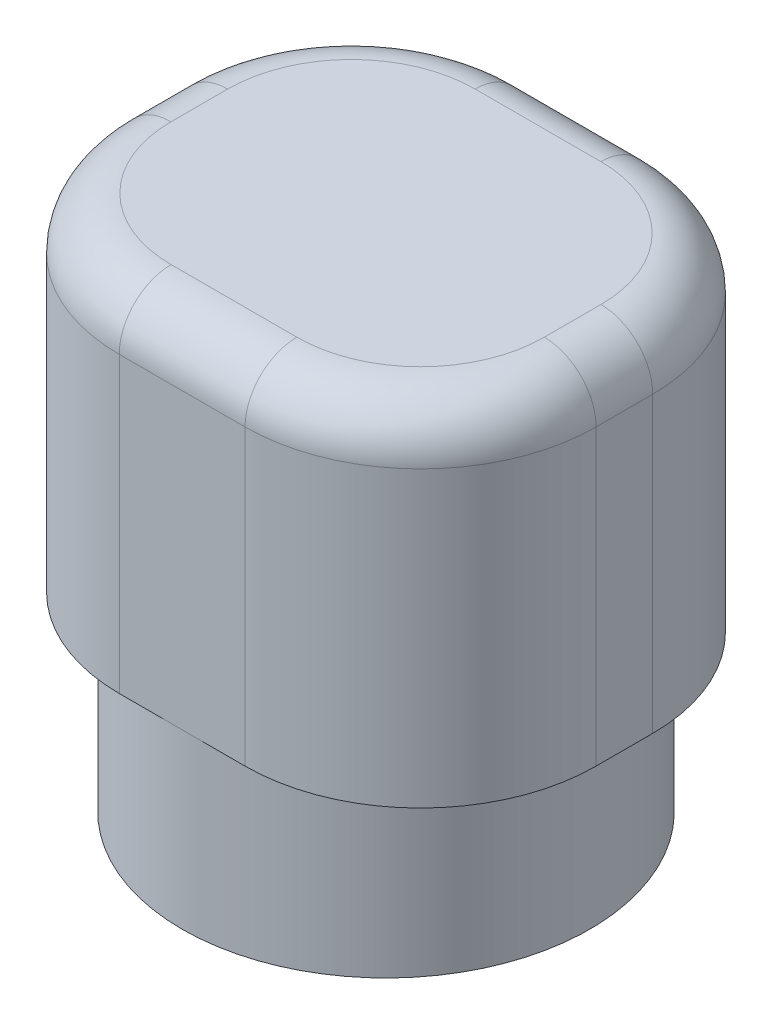
ISO-10303-21;
HEADER;
FILE_DESCRIPTION(('STEP AP214'),'2;1');
FILE_NAME('part.step','',(''),(''),'','','');
FILE_SCHEMA(('AUTOMOTIVE_DESIGN { 1 0 10303 214 1 1 1 1 }'));
ENDSEC;
DATA;
#1=APPLICATION_CONTEXT('core data for automotive mechanical design processes');
#2=APPLICATION_PROTOCOL_DEFINITION('international standard','automotive_design',2000,#1);
#3=PRODUCT_CONTEXT('',#1,'mechanical');
#4=PRODUCT('Part','Part','',(#3));
#5=PRODUCT_RELATED_PRODUCT_CATEGORY('part','',(#4));
#6=PRODUCT_DEFINITION_FORMATION('','',#4);
#7=PRODUCT_DEFINITION_CONTEXT('part definition',#1,'design');
#8=PRODUCT_DEFINITION('design','',#6,#7);
#9=PRODUCT_DEFINITION_SHAPE('','',#8);
#10=(LENGTH_UNIT() NAMED_UNIT(*) SI_UNIT(.MILLI.,.METRE.));
#11=(NAMED_UNIT(*) PLANE_ANGLE_UNIT() SI_UNIT($,.RADIAN.));
#12=(NAMED_UNIT(*) SI_UNIT($,.STERADIAN.) SOLID_ANGLE_UNIT());
#13=UNCERTAINTY_MEASURE_WITH_UNIT(LENGTH_MEASURE(1.E-05),#10,'distance_accuracy_value','');
#14=(GEOMETRIC_REPRESENTATION_CONTEXT(3) GLOBAL_UNCERTAINTY_ASSIGNED_CONTEXT((#13)) GLOBAL_UNIT_ASSIGNED_CONTEXT((#10,
#11,#12)) REPRESENTATION_CONTEXT('',''));
#15=CARTESIAN_POINT('',(0.,0.,0.));
#16=DIRECTION('',(0.,0.,1.));
#17=DIRECTION('',(1.,0.,0.));
#18=AXIS2_PLACEMENT_3D('',#15,#16,#17);
#19=CARTESIAN_POINT('',(0.,2.5,0.));
#20=DIRECTION('',(0.,-1.,0.));
#21=DIRECTION('',(0.,0.,-1.));
#22=AXIS2_PLACEMENT_3D('',#19,#20,#21);
#23=CYLINDRICAL_SURFACE('',#22,2.95);
#24=CARTESIAN_POINT('',(0.,2.5,0.));
#25=DIRECTION('',(0.,1.,0.));
#26=DIRECTION('',(0.,0.,1.));
#27=AXIS2_PLACEMENT_3D('',#24,#25,#26);
#28=CIRCLE('',#27,2.95);
#29=CARTESIAN_POINT('',(0.,2.5,2.95));
#30=VERTEX_POINT('',#29);
#31=CARTESIAN_POINT('',(0.,2.5,-2.95));
#32=VERTEX_POINT('',#31);
#33=EDGE_CURVE('E155',#30,#32,#28,.T.);
#34=ORIENTED_EDGE('',*,*,#33,.F.);
#35=EDGE_CURVE('E157',#32,#30,#28,.T.);
#36=ORIENTED_EDGE('',*,*,#35,.F.);
#37=EDGE_LOOP('',(#34,#36));
#38=FACE_BOUND('',#37,.T.);
#39=CARTESIAN_POINT('',(0.,0.,0.));
#40=DIRECTION('',(0.,1.,0.));
#41=DIRECTION('',(0.,0.,1.));
#42=AXIS2_PLACEMENT_3D('',#39,#40,#41);
#43=CIRCLE('',#42,2.95);
#44=CARTESIAN_POINT('',(0.,0.,2.95));
#45=VERTEX_POINT('',#44);
#46=EDGE_CURVE('E167',#45,#45,#43,.T.);
#47=ORIENTED_EDGE('',*,*,#46,.T.);
#48=EDGE_LOOP('',(#47));
#49=FACE_BOUND('',#48,.T.);
#50=ADVANCED_FACE('F45',(#38,#49),#23,.T.);
#51=CARTESIAN_POINT('',(0.,0.,0.));
#52=DIRECTION('',(0.,1.,0.));
#53=DIRECTION('',(0.,0.,1.));
#54=AXIS2_PLACEMENT_3D('',#51,#52,#53);
#55=PLANE('',#54);
#56=CARTESIAN_POINT('',(0.,0.,0.));
#57=DIRECTION('',(0.,-1.,0.));
#58=DIRECTION('',(0.,0.,-1.));
#59=AXIS2_PLACEMENT_3D('',#56,#57,#58);
#60=CIRCLE('',#59,1.75);
#61=CARTESIAN_POINT('',(0.,0.,-1.75));
#62=VERTEX_POINT('',#61);
#63=EDGE_CURVE('E150',#62,#62,#60,.T.);
#64=ORIENTED_EDGE('',*,*,#63,.F.);
#65=EDGE_LOOP('',(#64));
#66=FACE_BOUND('',#65,.T.);
#67=ORIENTED_EDGE('',*,*,#46,.F.);
#68=EDGE_LOOP('',(#67));
#69=FACE_BOUND('',#68,.T.);
#70=ADVANCED_FACE('F323',(#66,#69),#55,.F.);
#71=CARTESIAN_POINT('',(0.,2.5,0.));
#72=DIRECTION('',(0.,-1.,0.));
#73=DIRECTION('',(0.,0.,-1.));
#74=AXIS2_PLACEMENT_3D('',#71,#72,#73);
#75=CYLINDRICAL_SURFACE('',#74,1.75);
#76=CARTESIAN_POINT('',(0.,2.5,0.));
#77=DIRECTION('',(0.,-1.,0.));
#78=DIRECTION('',(0.,0.,-1.));
#79=AXIS2_PLACEMENT_3D('',#76,#77,#78);
#80=CIRCLE('',#79,1.75);
#81=CARTESIAN_POINT('',(0.,2.5,-1.75));
#82=VERTEX_POINT('',#81);
#83=EDGE_CURVE('E178',#82,#82,#80,.T.);
#84=ORIENTED_EDGE('',*,*,#83,.F.);
#85=EDGE_LOOP('',(#84));
#86=FACE_BOUND('',#85,.T.);
#87=ORIENTED_EDGE('',*,*,#63,.T.);
#88=EDGE_LOOP('',(#87));
#89=FACE_BOUND('',#88,.T.);
#90=ADVANCED_FACE('F330',(#86,#89),#75,.F.);
#91=CARTESIAN_POINT('',(0.,7.5,0.));
#92=DIRECTION('',(0.,1.,0.));
#93=DIRECTION('',(0.,0.,1.));
#94=AXIS2_PLACEMENT_3D('',#91,#92,#93);
#95=PLANE('',#94);
#96=CARTESIAN_POINT('',(0.909999999999999,7.5,0.409999999999999));
#97=DIRECTION('',(0.,1.,0.));
#98=DIRECTION('',(0.,0.,1.));
#99=AXIS2_PLACEMENT_3D('',#96,#97,#98);
#100=CIRCLE('',#99,1.79);
#101=CARTESIAN_POINT('',(0.909999999999999,7.5,2.2));
#102=VERTEX_POINT('',#101);
#103=CARTESIAN_POINT('',(2.7,7.5,0.409999999999999));
#104=VERTEX_POINT('',#103);
#105=EDGE_CURVE('E220',#102,#104,#100,.T.);
#106=ORIENTED_EDGE('',*,*,#105,.T.);
#107=DIRECTION('',(0.,0.,-1.));
#108=VECTOR('',#107,1.);
#109=CARTESIAN_POINT('',(2.7,7.5,-0.410000000000001));
#110=LINE('',#109,#108);
#111=CARTESIAN_POINT('',(2.7,7.5,-0.410000000000001));
#112=VERTEX_POINT('',#111);
#113=EDGE_CURVE('E222',#104,#112,#110,.T.);
#114=ORIENTED_EDGE('',*,*,#113,.T.);
#115=CARTESIAN_POINT('',(0.909999999999998,7.5,-0.41));
#116=DIRECTION('',(0.,1.,0.));
#117=DIRECTION('',(0.,0.,1.));
#118=AXIS2_PLACEMENT_3D('',#115,#116,#117);
#119=CIRCLE('',#118,1.79);
#120=CARTESIAN_POINT('',(0.909999999999998,7.5,-2.2));
#121=VERTEX_POINT('',#120);
#122=EDGE_CURVE('E218',#112,#121,#119,.T.);
#123=ORIENTED_EDGE('',*,*,#122,.T.);
#124=DIRECTION('',(-1.,0.,0.));
#125=VECTOR('',#124,1.);
#126=CARTESIAN_POINT('',(-0.910000000000001,7.5,-2.2));
#127=LINE('',#126,#125);
#128=CARTESIAN_POINT('',(-0.910000000000001,7.5,-2.2));
#129=VERTEX_POINT('',#128);
#130=EDGE_CURVE('E216',#121,#129,#127,.T.);
#131=ORIENTED_EDGE('',*,*,#130,.T.);
#132=CARTESIAN_POINT('',(-0.910000000000001,7.5,-0.41));
#133=DIRECTION('',(0.,1.,0.));
#134=DIRECTION('',(0.,0.,1.));
#135=AXIS2_PLACEMENT_3D('',#132,#133,#134);
#136=CIRCLE('',#135,1.79);
#137=CARTESIAN_POINT('',(-2.7,7.5,-0.41));
#138=VERTEX_POINT('',#137);
#139=EDGE_CURVE('E214',#129,#138,#136,.T.);
#140=ORIENTED_EDGE('',*,*,#139,.T.);
#141=DIRECTION('',(0.,0.,1.));
#142=VECTOR('',#141,1.);
#143=CARTESIAN_POINT('',(-2.7,7.5,0.41));
#144=LINE('',#143,#142);
#145=CARTESIAN_POINT('',(-2.7,7.5,0.41));
#146=VERTEX_POINT('',#145);
#147=EDGE_CURVE('E212',#138,#146,#144,.T.);
#148=ORIENTED_EDGE('',*,*,#147,.T.);
#149=CARTESIAN_POINT('',(-0.910000000000001,7.5,0.409999999999999));
#150=DIRECTION('',(0.,1.,0.));
#151=DIRECTION('',(0.,0.,1.));
#152=AXIS2_PLACEMENT_3D('',#149,#150,#151);
#153=CIRCLE('',#152,1.79);
#154=CARTESIAN_POINT('',(-0.910000000000001,7.5,2.2));
#155=VERTEX_POINT('',#154);
#156=EDGE_CURVE('E210',#146,#155,#153,.T.);
#157=ORIENTED_EDGE('',*,*,#156,.T.);
#158=DIRECTION('',(1.,0.,0.));
#159=VECTOR('',#158,1.);
#160=CARTESIAN_POINT('',(0.909999999999999,7.5,2.2));
#161=LINE('',#160,#159);
#162=EDGE_CURVE('E208',#155,#102,#161,.T.);
#163=ORIENTED_EDGE('',*,*,#162,.T.);
#164=EDGE_LOOP('',(#106,#114,#123,#131,#140,#148,#157,#163));
#165=FACE_BOUND('',#164,.T.);
#166=ADVANCED_FACE('F292',(#165),#95,.T.);
#167=CARTESIAN_POINT('',(-3.45,7.5,2.95));
#168=DIRECTION('',(0.,0.,-1.));
#169=DIRECTION('',(-1.,0.,0.));
#170=AXIS2_PLACEMENT_3D('',#167,#168,#169);
#171=PLANE('',#170);
#172=DIRECTION('',(0.,-1.,0.));
#173=VECTOR('',#172,1.);
#174=CARTESIAN_POINT('',(0.909999999999999,7.5,2.95));
#175=LINE('',#174,#173);
#176=CARTESIAN_POINT('',(0.909999999999999,2.5,2.95));
#177=VERTEX_POINT('',#176);
#178=CARTESIAN_POINT('',(0.909999999999999,6.75,2.95));
#179=VERTEX_POINT('',#178);
#180=EDGE_CURVE('E206',#177,#179,#175,.F.);
#181=ORIENTED_EDGE('',*,*,#180,.T.);
#182=DIRECTION('',(1.,0.,0.));
#183=VECTOR('',#182,1.);
#184=CARTESIAN_POINT('',(-0.910000000000001,6.75,2.95));
#185=LINE('',#184,#183);
#186=CARTESIAN_POINT('',(-0.910000000000001,6.75,2.95));
#187=VERTEX_POINT('',#186);
#188=EDGE_CURVE('E11',#179,#187,#185,.F.);
#189=ORIENTED_EDGE('',*,*,#188,.T.);
#190=DIRECTION('',(0.,-1.,0.));
#191=VECTOR('',#190,1.);
#192=CARTESIAN_POINT('',(-0.910000000000001,7.5,2.95));
#193=LINE('',#192,#191);
#194=CARTESIAN_POINT('',(-0.910000000000001,2.5,2.95));
#195=VERTEX_POINT('',#194);
#196=EDGE_CURVE('E146',#187,#195,#193,.T.);
#197=ORIENTED_EDGE('',*,*,#196,.T.);
#198=DIRECTION('',(1.,0.,0.));
#199=VECTOR('',#198,1.);
#200=CARTESIAN_POINT('',(-3.45,2.5,2.95));
#201=LINE('',#200,#199);
#202=EDGE_CURVE('E140',#195,#30,#201,.T.);
#203=ORIENTED_EDGE('',*,*,#202,.T.);
#204=EDGE_CURVE('E144',#30,#177,#201,.T.);
#205=ORIENTED_EDGE('',*,*,#204,.T.);
#206=EDGE_LOOP('',(#181,#189,#197,#203,#205));
#207=FACE_BOUND('',#206,.T.);
#208=ADVANCED_FACE('F142',(#207),#171,.F.);
#209=CARTESIAN_POINT('',(-3.45,7.5,-2.95));
#210=DIRECTION('',(1.,0.,0.));
#211=DIRECTION('',(0.,0.,-1.));
#212=AXIS2_PLACEMENT_3D('',#209,#210,#211);
#213=PLANE('',#212);
#214=DIRECTION('',(0.,-1.,0.));
#215=VECTOR('',#214,1.);
#216=CARTESIAN_POINT('',(-3.45,7.5,0.41));
#217=LINE('',#216,#215);
#218=CARTESIAN_POINT('',(-3.45,2.5,0.41));
#219=VERTEX_POINT('',#218);
#220=CARTESIAN_POINT('',(-3.45,6.75,0.41));
#221=VERTEX_POINT('',#220);
#222=EDGE_CURVE('E161',#219,#221,#217,.F.);
#223=ORIENTED_EDGE('',*,*,#222,.T.);
#224=DIRECTION('',(0.,0.,1.));
#225=VECTOR('',#224,1.);
#226=CARTESIAN_POINT('',(-3.45,6.75,-0.41));
#227=LINE('',#226,#225);
#228=CARTESIAN_POINT('',(-3.45,6.75,-0.41));
#229=VERTEX_POINT('',#228);
#230=EDGE_CURVE('E236',#221,#229,#227,.F.);
#231=ORIENTED_EDGE('',*,*,#230,.T.);
#232=DIRECTION('',(0.,-1.,0.));
#233=VECTOR('',#232,1.);
#234=CARTESIAN_POINT('',(-3.45,7.5,-0.41));
#235=LINE('',#234,#233);
#236=CARTESIAN_POINT('',(-3.45,2.5,-0.41));
#237=VERTEX_POINT('',#236);
#238=EDGE_CURVE('E186',#229,#237,#235,.T.);
#239=ORIENTED_EDGE('',*,*,#238,.T.);
#240=DIRECTION('',(0.,0.,1.));
#241=VECTOR('',#240,1.);
#242=CARTESIAN_POINT('',(-3.45,2.5,-2.95));
#243=LINE('',#242,#241);
#244=EDGE_CURVE('E172',#237,#219,#243,.T.);
#245=ORIENTED_EDGE('',*,*,#244,.T.);
#246=EDGE_LOOP('',(#223,#231,#239,#245));
#247=FACE_BOUND('',#246,.T.);
#248=ADVANCED_FACE('F309',(#247),#213,.F.);
#249=CARTESIAN_POINT('',(-3.45,7.5,-2.95));
#250=DIRECTION('',(0.,0.,1.));
#251=DIRECTION('',(1.,0.,0.));
#252=AXIS2_PLACEMENT_3D('',#249,#250,#251);
#253=PLANE('',#252);
#254=DIRECTION('',(0.,-1.,0.));
#255=VECTOR('',#254,1.);
#256=CARTESIAN_POINT('',(-0.910000000000001,7.5,-2.95));
#257=LINE('',#256,#255);
#258=CARTESIAN_POINT('',(-0.910000000000001,2.5,-2.95));
#259=VERTEX_POINT('',#258);
#260=CARTESIAN_POINT('',(-0.910000000000001,6.75,-2.95));
#261=VERTEX_POINT('',#260);
#262=EDGE_CURVE('E194',#259,#261,#257,.F.);
#263=ORIENTED_EDGE('',*,*,#262,.T.);
#264=DIRECTION('',(-1.,0.,0.));
#265=VECTOR('',#264,1.);
#266=CARTESIAN_POINT('',(0.909999999999998,6.75,-2.95));
#267=LINE('',#266,#265);
#268=CARTESIAN_POINT('',(0.909999999999998,6.75,-2.95));
#269=VERTEX_POINT('',#268);
#270=EDGE_CURVE('E232',#261,#269,#267,.F.);
#271=ORIENTED_EDGE('',*,*,#270,.T.);
#272=DIRECTION('',(0.,-1.,0.));
#273=VECTOR('',#272,1.);
#274=CARTESIAN_POINT('',(0.909999999999998,7.5,-2.95));
#275=LINE('',#274,#273);
#276=CARTESIAN_POINT('',(0.909999999999998,2.5,-2.95));
#277=VERTEX_POINT('',#276);
#278=EDGE_CURVE('E192',#269,#277,#275,.T.);
#279=ORIENTED_EDGE('',*,*,#278,.T.);
#280=DIRECTION('',(-1.,0.,0.));
#281=VECTOR('',#280,1.);
#282=CARTESIAN_POINT('',(-3.45,2.5,-2.95));
#283=LINE('',#282,#281);
#284=EDGE_CURVE('E174',#277,#32,#283,.T.);
#285=ORIENTED_EDGE('',*,*,#284,.T.);
#286=EDGE_CURVE('E166',#32,#259,#283,.T.);
#287=ORIENTED_EDGE('',*,*,#286,.T.);
#288=EDGE_LOOP('',(#263,#271,#279,#285,#287));
#289=FACE_BOUND('',#288,.T.);
#290=ADVANCED_FACE('F270',(#289),#253,.F.);
#291=CARTESIAN_POINT('',(3.45,7.5,-2.95));
#292=DIRECTION('',(-1.,0.,0.));
#293=DIRECTION('',(0.,0.,1.));
#294=AXIS2_PLACEMENT_3D('',#291,#292,#293);
#295=PLANE('',#294);
#296=DIRECTION('',(0.,-1.,0.));
#297=VECTOR('',#296,1.);
#298=CARTESIAN_POINT('',(3.45,7.5,-0.410000000000001));
#299=LINE('',#298,#297);
#300=CARTESIAN_POINT('',(3.45,2.5,-0.410000000000001));
#301=VERTEX_POINT('',#300);
#302=CARTESIAN_POINT('',(3.45,6.75,-0.410000000000001));
#303=VERTEX_POINT('',#302);
#304=EDGE_CURVE('E202',#301,#303,#299,.F.);
#305=ORIENTED_EDGE('',*,*,#304,.T.);
#306=DIRECTION('',(0.,0.,-1.));
#307=VECTOR('',#306,1.);
#308=CARTESIAN_POINT('',(3.45,6.75,0.409999999999999));
#309=LINE('',#308,#307);
#310=CARTESIAN_POINT('',(3.45,6.75,0.409999999999999));
#311=VERTEX_POINT('',#310);
#312=EDGE_CURVE('E225',#303,#311,#309,.F.);
#313=ORIENTED_EDGE('',*,*,#312,.T.);
#314=DIRECTION('',(0.,-1.,0.));
#315=VECTOR('',#314,1.);
#316=CARTESIAN_POINT('',(3.45,7.5,0.409999999999999));
#317=LINE('',#316,#315);
#318=CARTESIAN_POINT('',(3.45,2.5,0.409999999999999));
#319=VERTEX_POINT('',#318);
#320=EDGE_CURVE('E200',#311,#319,#317,.T.);
#321=ORIENTED_EDGE('',*,*,#320,.T.);
#322=DIRECTION('',(0.,0.,-1.));
#323=VECTOR('',#322,1.);
#324=CARTESIAN_POINT('',(3.45,2.5,-2.95));
#325=LINE('',#324,#323);
#326=EDGE_CURVE('E261',#319,#301,#325,.T.);
#327=ORIENTED_EDGE('',*,*,#326,.T.);
#328=EDGE_LOOP('',(#305,#313,#321,#327));
#329=FACE_BOUND('',#328,.T.);
#330=ADVANCED_FACE('F279',(#329),#295,.F.);
#331=CARTESIAN_POINT('',(0.,2.5,0.));
#332=DIRECTION('',(0.,1.,0.));
#333=DIRECTION('',(0.,0.,1.));
#334=AXIS2_PLACEMENT_3D('',#331,#332,#333);
#335=PLANE('',#334);
#336=ORIENTED_EDGE('',*,*,#244,.F.);
#337=CARTESIAN_POINT('',(-0.910000000000001,2.5,-0.41));
#338=DIRECTION('',(0.,1.,0.));
#339=DIRECTION('',(0.,0.,1.));
#340=AXIS2_PLACEMENT_3D('',#337,#338,#339);
#341=CIRCLE('',#340,2.54);
#342=EDGE_CURVE('E190',#237,#259,#341,.F.);
#343=ORIENTED_EDGE('',*,*,#342,.T.);
#344=ORIENTED_EDGE('',*,*,#286,.F.);
#345=ORIENTED_EDGE('',*,*,#35,.T.);
#346=ORIENTED_EDGE('',*,*,#202,.F.);
#347=CARTESIAN_POINT('',(-0.910000000000001,2.5,0.409999999999999));
#348=DIRECTION('',(0.,1.,0.));
#349=DIRECTION('',(0.,0.,1.));
#350=AXIS2_PLACEMENT_3D('',#347,#348,#349);
#351=CIRCLE('',#350,2.54);
#352=EDGE_CURVE('E188',#195,#219,#351,.F.);
#353=ORIENTED_EDGE('',*,*,#352,.T.);
#354=EDGE_LOOP('',(#336,#343,#344,#345,#346,#353));
#355=FACE_BOUND('',#354,.T.);
#356=ADVANCED_FACE('F164',(#355),#335,.F.);
#357=ORIENTED_EDGE('',*,*,#284,.F.);
#358=CARTESIAN_POINT('',(0.909999999999998,2.5,-0.41));
#359=DIRECTION('',(0.,1.,0.));
#360=DIRECTION('',(0.,0.,1.));
#361=AXIS2_PLACEMENT_3D('',#358,#359,#360);
#362=CIRCLE('',#361,2.54);
#363=EDGE_CURVE('E198',#277,#301,#362,.F.);
#364=ORIENTED_EDGE('',*,*,#363,.T.);
#365=ORIENTED_EDGE('',*,*,#326,.F.);
#366=CARTESIAN_POINT('',(0.909999999999999,2.5,0.409999999999999));
#367=DIRECTION('',(0.,1.,0.));
#368=DIRECTION('',(0.,0.,1.));
#369=AXIS2_PLACEMENT_3D('',#366,#367,#368);
#370=CIRCLE('',#369,2.54);
#371=EDGE_CURVE('E171',#319,#177,#370,.F.);
#372=ORIENTED_EDGE('',*,*,#371,.T.);
#373=ORIENTED_EDGE('',*,*,#204,.F.);
#374=ORIENTED_EDGE('',*,*,#33,.T.);
#375=EDGE_LOOP('',(#357,#364,#365,#372,#373,#374));
#376=FACE_BOUND('',#375,.T.);
#377=ADVANCED_FACE('F168',(#376),#335,.F.);
#378=ORIENTED_EDGE('',*,*,#83,.T.);
#379=EDGE_LOOP('',(#378));
#380=FACE_BOUND('',#379,.T.);
#381=ADVANCED_FACE('F337',(#380),#335,.F.);
#382=CARTESIAN_POINT('',(-0.910000000000001,7.5,-0.41));
#383=DIRECTION('',(0.,-1.,0.));
#384=DIRECTION('',(0.,0.,-1.));
#385=AXIS2_PLACEMENT_3D('',#382,#383,#384);
#386=CYLINDRICAL_SURFACE('',#385,2.54);
#387=ORIENTED_EDGE('',*,*,#238,.F.);
#388=CARTESIAN_POINT('',(-0.910000000000001,6.75,-0.41));
#389=DIRECTION('',(0.,1.,0.));
#390=DIRECTION('',(0.,0.,1.));
#391=AXIS2_PLACEMENT_3D('',#388,#389,#390);
#392=CIRCLE('',#391,2.54);
#393=EDGE_CURVE('E234',#229,#261,#392,.F.);
#394=ORIENTED_EDGE('',*,*,#393,.T.);
#395=ORIENTED_EDGE('',*,*,#262,.F.);
#396=ORIENTED_EDGE('',*,*,#342,.F.);
#397=EDGE_LOOP('',(#387,#394,#395,#396));
#398=FACE_BOUND('',#397,.T.);
#399=ADVANCED_FACE('F312',(#398),#386,.T.);
#400=CARTESIAN_POINT('',(0.909999999999998,7.5,-0.41));
#401=DIRECTION('',(0.,-1.,0.));
#402=DIRECTION('',(0.,0.,-1.));
#403=AXIS2_PLACEMENT_3D('',#400,#401,#402);
#404=CYLINDRICAL_SURFACE('',#403,2.54);
#405=ORIENTED_EDGE('',*,*,#278,.F.);
#406=CARTESIAN_POINT('',(0.909999999999998,6.75,-0.41));
#407=DIRECTION('',(0.,1.,0.));
#408=DIRECTION('',(0.,0.,1.));
#409=AXIS2_PLACEMENT_3D('',#406,#407,#408);
#410=CIRCLE('',#409,2.54);
#411=EDGE_CURVE('E230',#269,#303,#410,.F.);
#412=ORIENTED_EDGE('',*,*,#411,.T.);
#413=ORIENTED_EDGE('',*,*,#304,.F.);
#414=ORIENTED_EDGE('',*,*,#363,.F.);
#415=EDGE_LOOP('',(#405,#412,#413,#414));
#416=FACE_BOUND('',#415,.T.);
#417=ADVANCED_FACE('F275',(#416),#404,.T.);
#418=CARTESIAN_POINT('',(0.909999999999999,7.5,0.409999999999999));
#419=DIRECTION('',(0.,-1.,0.));
#420=DIRECTION('',(0.,0.,-1.));
#421=AXIS2_PLACEMENT_3D('',#418,#419,#420);
#422=CYLINDRICAL_SURFACE('',#421,2.54);
#423=ORIENTED_EDGE('',*,*,#320,.F.);
#424=CARTESIAN_POINT('',(0.909999999999999,6.75,0.409999999999999));
#425=DIRECTION('',(0.,1.,0.));
#426=DIRECTION('',(0.,0.,1.));
#427=AXIS2_PLACEMENT_3D('',#424,#425,#426);
#428=CIRCLE('',#427,2.54);
#429=EDGE_CURVE('E228',#311,#179,#428,.F.);
#430=ORIENTED_EDGE('',*,*,#429,.T.);
#431=ORIENTED_EDGE('',*,*,#180,.F.);
#432=ORIENTED_EDGE('',*,*,#371,.F.);
#433=EDGE_LOOP('',(#423,#430,#431,#432));
#434=FACE_BOUND('',#433,.T.);
#435=ADVANCED_FACE('F299',(#434),#422,.T.);
#436=CARTESIAN_POINT('',(-0.910000000000001,7.5,0.409999999999999));
#437=DIRECTION('',(0.,-1.,0.));
#438=DIRECTION('',(0.,0.,-1.));
#439=AXIS2_PLACEMENT_3D('',#436,#437,#438);
#440=CYLINDRICAL_SURFACE('',#439,2.54);
#441=ORIENTED_EDGE('',*,*,#196,.F.);
#442=CARTESIAN_POINT('',(-0.910000000000001,6.75,0.409999999999999));
#443=DIRECTION('',(0.,1.,0.));
#444=DIRECTION('',(0.,0.,1.));
#445=AXIS2_PLACEMENT_3D('',#442,#443,#444);
#446=CIRCLE('',#445,2.54);
#447=EDGE_CURVE('E54',#187,#221,#446,.F.);
#448=ORIENTED_EDGE('',*,*,#447,.T.);
#449=ORIENTED_EDGE('',*,*,#222,.F.);
#450=ORIENTED_EDGE('',*,*,#352,.F.);
#451=EDGE_LOOP('',(#441,#448,#449,#450));
#452=FACE_BOUND('',#451,.T.);
#453=ADVANCED_FACE('F313',(#452),#440,.T.);
#454=CARTESIAN_POINT('',(-2.7,6.75,0.));
#455=DIRECTION('',(0.,0.,-1.));
#456=DIRECTION('',(-1.,0.,0.));
#457=AXIS2_PLACEMENT_3D('',#454,#455,#456);
#458=CYLINDRICAL_SURFACE('',#457,0.75);
#459=CARTESIAN_POINT('',(-2.7,6.75,-0.41));
#460=DIRECTION('',(0.,0.,-1.));
#461=DIRECTION('',(-1.,0.,0.));
#462=AXIS2_PLACEMENT_3D('',#459,#460,#461);
#463=CIRCLE('',#462,0.75);
#464=EDGE_CURVE('E254',#229,#138,#463,.T.);
#465=ORIENTED_EDGE('',*,*,#464,.F.);
#466=ORIENTED_EDGE('',*,*,#230,.F.);
#467=CARTESIAN_POINT('',(-2.7,6.75,0.41));
#468=DIRECTION('',(0.,0.,1.));
#469=DIRECTION('',(1.,0.,0.));
#470=AXIS2_PLACEMENT_3D('',#467,#468,#469);
#471=CIRCLE('',#470,0.75);
#472=EDGE_CURVE('E49',#146,#221,#471,.T.);
#473=ORIENTED_EDGE('',*,*,#472,.F.);
#474=ORIENTED_EDGE('',*,*,#147,.F.);
#475=EDGE_LOOP('',(#465,#466,#473,#474));
#476=FACE_BOUND('',#475,.T.);
#477=ADVANCED_FACE('F47',(#476),#458,.T.);
#478=CARTESIAN_POINT('',(-0.910000000000001,6.75,0.409999999999999));
#479=DIRECTION('',(0.,1.,0.));
#480=DIRECTION('',(0.,0.,1.));
#481=AXIS2_PLACEMENT_3D('',#478,#479,#480);
#482=TOROIDAL_SURFACE('',#481,1.79,0.75);
#483=ORIENTED_EDGE('',*,*,#472,.T.);
#484=ORIENTED_EDGE('',*,*,#447,.F.);
#485=CARTESIAN_POINT('',(-0.910000000000001,6.75,2.2));
#486=DIRECTION('',(1.,0.,0.));
#487=DIRECTION('',(0.,0.,-1.));
#488=AXIS2_PLACEMENT_3D('',#485,#486,#487);
#489=CIRCLE('',#488,0.75);
#490=EDGE_CURVE('E252',#155,#187,#489,.T.);
#491=ORIENTED_EDGE('',*,*,#490,.F.);
#492=ORIENTED_EDGE('',*,*,#156,.F.);
#493=EDGE_LOOP('',(#483,#484,#491,#492));
#494=FACE_BOUND('',#493,.T.);
#495=ADVANCED_FACE('F303',(#494),#482,.T.);
#496=CARTESIAN_POINT('',(-0.910000000000001,6.75,-0.41));
#497=DIRECTION('',(0.,1.,0.));
#498=DIRECTION('',(0.,0.,1.));
#499=AXIS2_PLACEMENT_3D('',#496,#497,#498);
#500=TOROIDAL_SURFACE('',#499,1.79,0.75);
#501=ORIENTED_EDGE('',*,*,#464,.T.);
#502=ORIENTED_EDGE('',*,*,#139,.F.);
#503=CARTESIAN_POINT('',(-0.910000000000001,6.75,-2.2));
#504=DIRECTION('',(1.,0.,0.));
#505=DIRECTION('',(0.,0.,-1.));
#506=AXIS2_PLACEMENT_3D('',#503,#504,#505);
#507=CIRCLE('',#506,0.75);
#508=EDGE_CURVE('E249',#261,#129,#507,.T.);
#509=ORIENTED_EDGE('',*,*,#508,.F.);
#510=ORIENTED_EDGE('',*,*,#393,.F.);
#511=EDGE_LOOP('',(#501,#502,#509,#510));
#512=FACE_BOUND('',#511,.T.);
#513=ADVANCED_FACE('F369',(#512),#500,.T.);
#514=CARTESIAN_POINT('',(0.,6.75,2.2));
#515=DIRECTION('',(-1.,0.,0.));
#516=DIRECTION('',(0.,0.,1.));
#517=AXIS2_PLACEMENT_3D('',#514,#515,#516);
#518=CYLINDRICAL_SURFACE('',#517,0.75);
#519=ORIENTED_EDGE('',*,*,#490,.T.);
#520=ORIENTED_EDGE('',*,*,#188,.F.);
#521=CARTESIAN_POINT('',(0.909999999999999,6.75,2.2));
#522=DIRECTION('',(1.,0.,0.));
#523=DIRECTION('',(0.,0.,-1.));
#524=AXIS2_PLACEMENT_3D('',#521,#522,#523);
#525=CIRCLE('',#524,0.75);
#526=EDGE_CURVE('E246',#102,#179,#525,.T.);
#527=ORIENTED_EDGE('',*,*,#526,.F.);
#528=ORIENTED_EDGE('',*,*,#162,.F.);
#529=EDGE_LOOP('',(#519,#520,#527,#528));
#530=FACE_BOUND('',#529,.T.);
#531=ADVANCED_FACE('F301',(#530),#518,.T.);
#532=CARTESIAN_POINT('',(0.,6.75,-2.2));
#533=DIRECTION('',(1.,0.,0.));
#534=DIRECTION('',(0.,0.,-1.));
#535=AXIS2_PLACEMENT_3D('',#532,#533,#534);
#536=CYLINDRICAL_SURFACE('',#535,0.75);
#537=ORIENTED_EDGE('',*,*,#508,.T.);
#538=ORIENTED_EDGE('',*,*,#130,.F.);
#539=CARTESIAN_POINT('',(0.909999999999998,6.75,-2.2));
#540=DIRECTION('',(1.,0.,0.));
#541=DIRECTION('',(0.,0.,-1.));
#542=AXIS2_PLACEMENT_3D('',#539,#540,#541);
#543=CIRCLE('',#542,0.75);
#544=EDGE_CURVE('E243',#269,#121,#543,.T.);
#545=ORIENTED_EDGE('',*,*,#544,.F.);
#546=ORIENTED_EDGE('',*,*,#270,.F.);
#547=EDGE_LOOP('',(#537,#538,#545,#546));
#548=FACE_BOUND('',#547,.T.);
#549=ADVANCED_FACE('F387',(#548),#536,.T.);
#550=CARTESIAN_POINT('',(0.909999999999999,6.75,0.409999999999999));
#551=DIRECTION('',(0.,1.,0.));
#552=DIRECTION('',(0.,0.,1.));
#553=AXIS2_PLACEMENT_3D('',#550,#551,#552);
#554=TOROIDAL_SURFACE('',#553,1.79,0.75);
#555=ORIENTED_EDGE('',*,*,#526,.T.);
#556=ORIENTED_EDGE('',*,*,#429,.F.);
#557=CARTESIAN_POINT('',(2.7,6.75,0.409999999999999));
#558=DIRECTION('',(0.,0.,-1.));
#559=DIRECTION('',(-1.,0.,0.));
#560=AXIS2_PLACEMENT_3D('',#557,#558,#559);
#561=CIRCLE('',#560,0.75);
#562=EDGE_CURVE('E241',#104,#311,#561,.T.);
#563=ORIENTED_EDGE('',*,*,#562,.F.);
#564=ORIENTED_EDGE('',*,*,#105,.F.);
#565=EDGE_LOOP('',(#555,#556,#563,#564));
#566=FACE_BOUND('',#565,.T.);
#567=ADVANCED_FACE('F297',(#566),#554,.T.);
#568=CARTESIAN_POINT('',(0.909999999999998,6.75,-0.41));
#569=DIRECTION('',(0.,1.,0.));
#570=DIRECTION('',(0.,0.,1.));
#571=AXIS2_PLACEMENT_3D('',#568,#569,#570);
#572=TOROIDAL_SURFACE('',#571,1.79,0.75);
#573=ORIENTED_EDGE('',*,*,#544,.T.);
#574=ORIENTED_EDGE('',*,*,#122,.F.);
#575=CARTESIAN_POINT('',(2.7,6.75,-0.410000000000001));
#576=DIRECTION('',(0.,0.,1.));
#577=DIRECTION('',(1.,0.,0.));
#578=AXIS2_PLACEMENT_3D('',#575,#576,#577);
#579=CIRCLE('',#578,0.75);
#580=EDGE_CURVE('E239',#303,#112,#579,.T.);
#581=ORIENTED_EDGE('',*,*,#580,.F.);
#582=ORIENTED_EDGE('',*,*,#411,.F.);
#583=EDGE_LOOP('',(#573,#574,#581,#582));
#584=FACE_BOUND('',#583,.T.);
#585=ADVANCED_FACE('F289',(#584),#572,.T.);
#586=CARTESIAN_POINT('',(2.7,6.75,0.));
#587=DIRECTION('',(0.,0.,1.));
#588=DIRECTION('',(1.,0.,0.));
#589=AXIS2_PLACEMENT_3D('',#586,#587,#588);
#590=CYLINDRICAL_SURFACE('',#589,0.75);
#591=ORIENTED_EDGE('',*,*,#562,.T.);
#592=ORIENTED_EDGE('',*,*,#312,.F.);
#593=ORIENTED_EDGE('',*,*,#580,.T.);
#594=ORIENTED_EDGE('',*,*,#113,.F.);
#595=EDGE_LOOP('',(#591,#592,#593,#594));
#596=FACE_BOUND('',#595,.T.);
#597=ADVANCED_FACE('F283',(#596),#590,.T.);
#598=CLOSED_SHELL('',(#50,#70,#90,#166,#208,#248,#290,#330,#356,#377,#381,#399,#417,#435,#453,
#477,#495,#513,#531,#549,#567,#585,#597));
#599=MANIFOLD_SOLID_BREP('B2',#598);
#600=ADVANCED_BREP_SHAPE_REPRESENTATION('',(#18,#599),#14);
#601=SHAPE_DEFINITION_REPRESENTATION(#9,#600);
ENDSEC;
END-ISO-10303-21;
